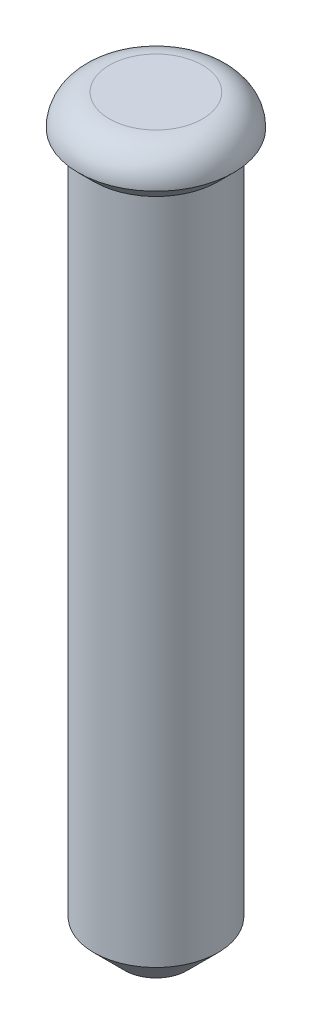
ISO-10303-21;
HEADER;
FILE_DESCRIPTION(('STEP AP214'),'2;1');
FILE_NAME('part.step','',(''),(''),'','','');
FILE_SCHEMA(('AUTOMOTIVE_DESIGN { 1 0 10303 214 1 1 1 1 }'));
ENDSEC;
DATA;
#1=APPLICATION_CONTEXT('core data for automotive mechanical design processes');
#2=APPLICATION_PROTOCOL_DEFINITION('international standard','automotive_design',2000,#1);
#3=PRODUCT_CONTEXT('',#1,'mechanical');
#4=PRODUCT('Part','Part','',(#3));
#5=PRODUCT_RELATED_PRODUCT_CATEGORY('part','',(#4));
#6=PRODUCT_DEFINITION_FORMATION('','',#4);
#7=PRODUCT_DEFINITION_CONTEXT('part definition',#1,'design');
#8=PRODUCT_DEFINITION('design','',#6,#7);
#9=PRODUCT_DEFINITION_SHAPE('','',#8);
#10=(LENGTH_UNIT() NAMED_UNIT(*) SI_UNIT(.MILLI.,.METRE.));
#11=(NAMED_UNIT(*) PLANE_ANGLE_UNIT() SI_UNIT($,.RADIAN.));
#12=(NAMED_UNIT(*) SI_UNIT($,.STERADIAN.) SOLID_ANGLE_UNIT());
#13=UNCERTAINTY_MEASURE_WITH_UNIT(LENGTH_MEASURE(1.E-05),#10,'distance_accuracy_value','');
#14=(GEOMETRIC_REPRESENTATION_CONTEXT(3) GLOBAL_UNCERTAINTY_ASSIGNED_CONTEXT((#13)) GLOBAL_UNIT_ASSIGNED_CONTEXT((#10,
#11,#12)) REPRESENTATION_CONTEXT('',''));
#15=CARTESIAN_POINT('',(0.,0.,0.));
#16=DIRECTION('',(0.,0.,1.));
#17=DIRECTION('',(1.,0.,0.));
#18=AXIS2_PLACEMENT_3D('',#15,#16,#17);
#19=CARTESIAN_POINT('',(0.,-11.,0.));
#20=DIRECTION('',(0.,1.,0.));
#21=DIRECTION('',(0.,0.,1.));
#22=AXIS2_PLACEMENT_3D('',#19,#20,#21);
#23=CYLINDRICAL_SURFACE('',#22,1.);
#24=CARTESIAN_POINT('',(0.,-10.5,0.));
#25=DIRECTION('',(0.,1.,0.));
#26=DIRECTION('',(0.,0.,1.));
#27=AXIS2_PLACEMENT_3D('',#24,#25,#26);
#28=CIRCLE('',#27,1.);
#29=CARTESIAN_POINT('',(0.,-10.5,1.));
#30=VERTEX_POINT('',#29);
#31=EDGE_CURVE('E50',#30,#30,#28,.T.);
#32=ORIENTED_EDGE('',*,*,#31,.T.);
#33=EDGE_LOOP('',(#32));
#34=FACE_BOUND('',#33,.T.);
#35=CARTESIAN_POINT('',(0.,0.250000000000006,0.));
#36=DIRECTION('',(0.,1.,0.));
#37=DIRECTION('',(0.,0.,1.));
#38=AXIS2_PLACEMENT_3D('',#35,#36,#37);
#39=CIRCLE('',#38,1.);
#40=CARTESIAN_POINT('',(0.,0.250000000000006,1.));
#41=VERTEX_POINT('',#40);
#42=EDGE_CURVE('E54',#41,#41,#39,.F.);
#43=ORIENTED_EDGE('',*,*,#42,.T.);
#44=EDGE_LOOP('',(#43));
#45=FACE_BOUND('',#44,.T.);
#46=ADVANCED_FACE('F39',(#34,#45),#23,.T.);
#47=CARTESIAN_POINT('',(0.,-11.,0.));
#48=DIRECTION('',(0.,1.,0.));
#49=DIRECTION('',(0.,0.,1.));
#50=AXIS2_PLACEMENT_3D('',#47,#48,#49);
#51=PLANE('',#50);
#52=CARTESIAN_POINT('',(0.,-11.,0.));
#53=DIRECTION('',(0.,1.,0.));
#54=DIRECTION('',(0.,0.,1.));
#55=AXIS2_PLACEMENT_3D('',#52,#53,#54);
#56=CIRCLE('',#55,0.499999999999995);
#57=CARTESIAN_POINT('',(0.,-11.,0.499999999999995));
#58=VERTEX_POINT('',#57);
#59=EDGE_CURVE('E46',#58,#58,#56,.F.);
#60=ORIENTED_EDGE('',*,*,#59,.T.);
#61=EDGE_LOOP('',(#60));
#62=FACE_BOUND('',#61,.T.);
#63=ADVANCED_FACE('F77',(#62),#51,.F.);
#64=CARTESIAN_POINT('',(0.,1.,0.));
#65=DIRECTION('',(0.,1.,0.));
#66=DIRECTION('',(0.,0.,1.));
#67=AXIS2_PLACEMENT_3D('',#64,#65,#66);
#68=PLANE('',#67);
#69=CARTESIAN_POINT('',(0.,1.,0.));
#70=DIRECTION('',(0.,1.,0.));
#71=DIRECTION('',(0.,0.,1.));
#72=AXIS2_PLACEMENT_3D('',#69,#70,#71);
#73=CIRCLE('',#72,0.75);
#74=CARTESIAN_POINT('',(0.,1.,0.75));
#75=VERTEX_POINT('',#74);
#76=EDGE_CURVE('E10',#75,#75,#73,.T.);
#77=ORIENTED_EDGE('',*,*,#76,.T.);
#78=EDGE_LOOP('',(#77));
#79=FACE_BOUND('',#78,.T.);
#80=ADVANCED_FACE('F68',(#79),#68,.T.);
#81=CARTESIAN_POINT('',(0.,0.500000000000009,0.));
#82=DIRECTION('',(0.,1.,0.));
#83=DIRECTION('',(0.,0.,1.));
#84=AXIS2_PLACEMENT_3D('',#81,#82,#83);
#85=CONICAL_SURFACE('',#84,1.25,0.785398163397443);
#86=ORIENTED_EDGE('',*,*,#42,.F.);
#87=EDGE_LOOP('',(#86));
#88=FACE_BOUND('',#87,.T.);
#89=CARTESIAN_POINT('',(0.,0.500000000000009,0.));
#90=DIRECTION('',(0.,1.,0.));
#91=DIRECTION('',(0.,0.,1.));
#92=AXIS2_PLACEMENT_3D('',#89,#90,#91);
#93=CIRCLE('',#92,1.25);
#94=CARTESIAN_POINT('',(0.,0.500000000000009,1.25));
#95=VERTEX_POINT('',#94);
#96=EDGE_CURVE('E59',#95,#95,#93,.T.);
#97=ORIENTED_EDGE('',*,*,#96,.F.);
#98=EDGE_LOOP('',(#97));
#99=FACE_BOUND('',#98,.T.);
#100=ADVANCED_FACE('F65',(#88,#99),#85,.T.);
#101=CARTESIAN_POINT('',(0.,-10.5,0.));
#102=DIRECTION('',(0.,1.,0.));
#103=DIRECTION('',(0.,0.,1.));
#104=AXIS2_PLACEMENT_3D('',#101,#102,#103);
#105=CONICAL_SURFACE('',#104,1.,0.785398163397449);
#106=ORIENTED_EDGE('',*,*,#59,.F.);
#107=EDGE_LOOP('',(#106));
#108=FACE_BOUND('',#107,.T.);
#109=ORIENTED_EDGE('',*,*,#31,.F.);
#110=EDGE_LOOP('',(#109));
#111=FACE_BOUND('',#110,.T.);
#112=ADVANCED_FACE('F67',(#108,#111),#105,.T.);
#113=CARTESIAN_POINT('',(0.,0.5,0.));
#114=DIRECTION('',(0.,1.,0.));
#115=DIRECTION('',(0.,0.,1.));
#116=AXIS2_PLACEMENT_3D('',#113,#114,#115);
#117=TOROIDAL_SURFACE('',#116,0.75,0.5);
#118=ORIENTED_EDGE('',*,*,#96,.T.);
#119=EDGE_LOOP('',(#118));
#120=FACE_BOUND('',#119,.T.);
#121=ORIENTED_EDGE('',*,*,#76,.F.);
#122=EDGE_LOOP('',(#121));
#123=FACE_BOUND('',#122,.T.);
#124=ADVANCED_FACE('F41',(#120,#123),#117,.T.);
#125=CLOSED_SHELL('',(#46,#63,#80,#100,#112,#124));
#126=MANIFOLD_SOLID_BREP('B2',#125);
#127=ADVANCED_BREP_SHAPE_REPRESENTATION('',(#18,#126),#14);
#128=SHAPE_DEFINITION_REPRESENTATION(#9,#127);
ENDSEC;
END-ISO-10303-21;
